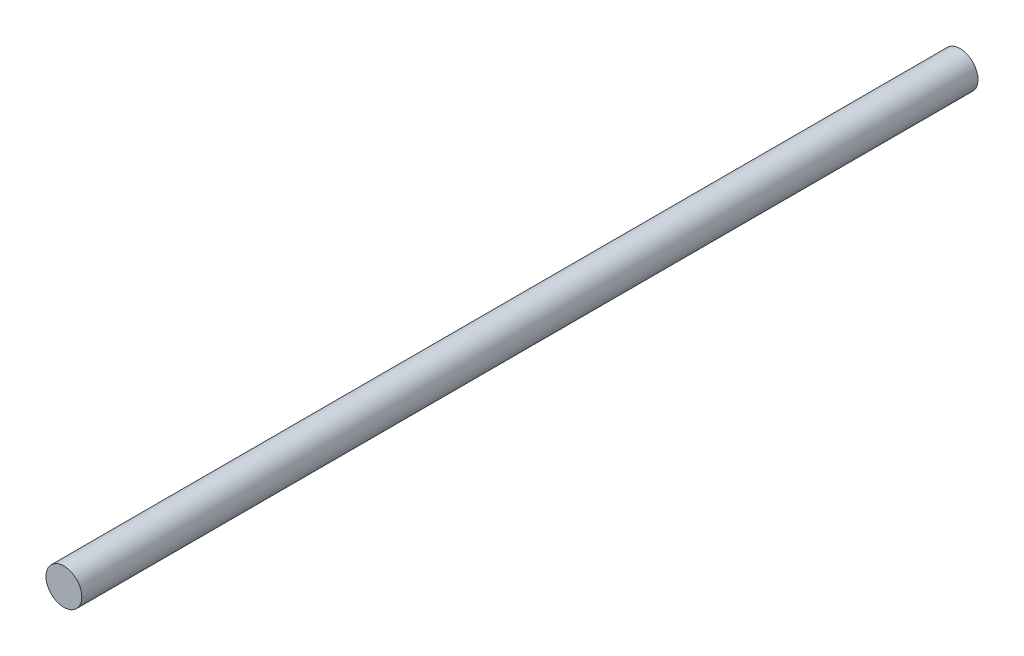
ISO-10303-21;
HEADER;
FILE_DESCRIPTION(('STEP AP214'),'2;1');
FILE_NAME('part.step','',(''),(''),'','','');
FILE_SCHEMA(('AUTOMOTIVE_DESIGN { 1 0 10303 214 1 1 1 1 }'));
ENDSEC;
DATA;
#1=APPLICATION_CONTEXT('core data for automotive mechanical design processes');
#2=APPLICATION_PROTOCOL_DEFINITION('international standard','automotive_design',2000,#1);
#3=PRODUCT_CONTEXT('',#1,'mechanical');
#4=PRODUCT('Part','Part','',(#3));
#5=PRODUCT_RELATED_PRODUCT_CATEGORY('part','',(#4));
#6=PRODUCT_DEFINITION_FORMATION('','',#4);
#7=PRODUCT_DEFINITION_CONTEXT('part definition',#1,'design');
#8=PRODUCT_DEFINITION('design','',#6,#7);
#9=PRODUCT_DEFINITION_SHAPE('','',#8);
#10=(LENGTH_UNIT() NAMED_UNIT(*) SI_UNIT(.MILLI.,.METRE.));
#11=(NAMED_UNIT(*) PLANE_ANGLE_UNIT() SI_UNIT($,.RADIAN.));
#12=(NAMED_UNIT(*) SI_UNIT($,.STERADIAN.) SOLID_ANGLE_UNIT());
#13=UNCERTAINTY_MEASURE_WITH_UNIT(LENGTH_MEASURE(1.E-05),#10,'distance_accuracy_value','');
#14=(GEOMETRIC_REPRESENTATION_CONTEXT(3) GLOBAL_UNCERTAINTY_ASSIGNED_CONTEXT((#13)) GLOBAL_UNIT_ASSIGNED_CONTEXT((#10,
#11,#12)) REPRESENTATION_CONTEXT('',''));
#15=CARTESIAN_POINT('',(0.,0.,0.));
#16=DIRECTION('',(0.,0.,1.));
#17=DIRECTION('',(1.,0.,0.));
#18=AXIS2_PLACEMENT_3D('',#15,#16,#17);
#19=CARTESIAN_POINT('',(0.,0.,200.));
#20=DIRECTION('',(0.,0.,-1.));
#21=DIRECTION('',(-1.,0.,0.));
#22=AXIS2_PLACEMENT_3D('',#19,#20,#21);
#23=CYLINDRICAL_SURFACE('',#22,4.);
#24=CARTESIAN_POINT('',(0.,0.,200.));
#25=DIRECTION('',(0.,0.,1.));
#26=DIRECTION('',(1.,0.,0.));
#27=AXIS2_PLACEMENT_3D('',#24,#25,#26);
#28=CIRCLE('',#27,4.);
#29=CARTESIAN_POINT('',(4.,0.,200.));
#30=VERTEX_POINT('',#29);
#31=EDGE_CURVE('E10',#30,#30,#28,.T.);
#32=ORIENTED_EDGE('',*,*,#31,.F.);
#33=EDGE_LOOP('',(#32));
#34=FACE_BOUND('',#33,.T.);
#35=CARTESIAN_POINT('',(0.,0.,0.));
#36=DIRECTION('',(0.,0.,1.));
#37=DIRECTION('',(1.,0.,0.));
#38=AXIS2_PLACEMENT_3D('',#35,#36,#37);
#39=CIRCLE('',#38,4.);
#40=CARTESIAN_POINT('',(4.,0.,0.));
#41=VERTEX_POINT('',#40);
#42=EDGE_CURVE('E46',#41,#41,#39,.T.);
#43=ORIENTED_EDGE('',*,*,#42,.T.);
#44=EDGE_LOOP('',(#43));
#45=FACE_BOUND('',#44,.T.);
#46=ADVANCED_FACE('F43',(#34,#45),#23,.T.);
#47=CARTESIAN_POINT('',(0.,0.,200.));
#48=DIRECTION('',(0.,0.,1.));
#49=DIRECTION('',(1.,0.,0.));
#50=AXIS2_PLACEMENT_3D('',#47,#48,#49);
#51=PLANE('',#50);
#52=ORIENTED_EDGE('',*,*,#31,.T.);
#53=EDGE_LOOP('',(#52));
#54=FACE_BOUND('',#53,.T.);
#55=ADVANCED_FACE('F60',(#54),#51,.T.);
#56=CARTESIAN_POINT('',(0.,0.,0.));
#57=DIRECTION('',(0.,0.,1.));
#58=DIRECTION('',(1.,0.,0.));
#59=AXIS2_PLACEMENT_3D('',#56,#57,#58);
#60=PLANE('',#59);
#61=ORIENTED_EDGE('',*,*,#42,.F.);
#62=EDGE_LOOP('',(#61));
#63=FACE_BOUND('',#62,.T.);
#64=ADVANCED_FACE('F58',(#63),#60,.F.);
#65=CLOSED_SHELL('',(#46,#55,#64));
#66=MANIFOLD_SOLID_BREP('B2',#65);
#67=ADVANCED_BREP_SHAPE_REPRESENTATION('',(#18,#66),#14);
#68=SHAPE_DEFINITION_REPRESENTATION(#9,#67);
ENDSEC;
END-ISO-10303-21;
